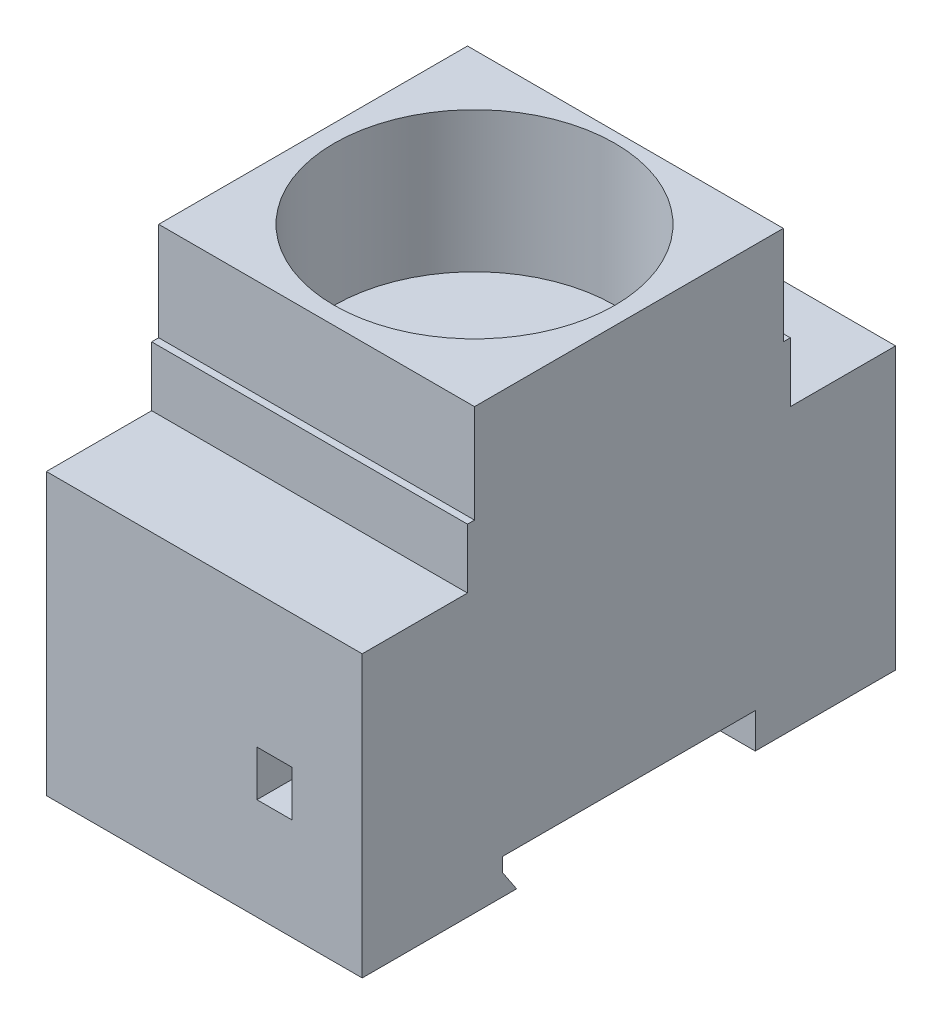
ISO-10303-21;
HEADER;
FILE_DESCRIPTION(('STEP AP214'),'2;1');
FILE_NAME('part.step','',(''),(''),'','','');
FILE_SCHEMA(('AUTOMOTIVE_DESIGN { 1 0 10303 214 1 1 1 1 }'));
ENDSEC;
DATA;
#1=APPLICATION_CONTEXT('core data for automotive mechanical design processes');
#2=APPLICATION_PROTOCOL_DEFINITION('international standard','automotive_design',2000,#1);
#3=PRODUCT_CONTEXT('',#1,'mechanical');
#4=PRODUCT('Part','Part','',(#3));
#5=PRODUCT_RELATED_PRODUCT_CATEGORY('part','',(#4));
#6=PRODUCT_DEFINITION_FORMATION('','',#4);
#7=PRODUCT_DEFINITION_CONTEXT('part definition',#1,'design');
#8=PRODUCT_DEFINITION('design','',#6,#7);
#9=PRODUCT_DEFINITION_SHAPE('','',#8);
#10=(LENGTH_UNIT() NAMED_UNIT(*) SI_UNIT(.MILLI.,.METRE.));
#11=(NAMED_UNIT(*) PLANE_ANGLE_UNIT() SI_UNIT($,.RADIAN.));
#12=(NAMED_UNIT(*) SI_UNIT($,.STERADIAN.) SOLID_ANGLE_UNIT());
#13=UNCERTAINTY_MEASURE_WITH_UNIT(LENGTH_MEASURE(1.E-05),#10,'distance_accuracy_value','');
#14=(GEOMETRIC_REPRESENTATION_CONTEXT(3) GLOBAL_UNCERTAINTY_ASSIGNED_CONTEXT((#13)) GLOBAL_UNIT_ASSIGNED_CONTEXT((#10,
#11,#12)) REPRESENTATION_CONTEXT('',''));
#15=CARTESIAN_POINT('',(0.,0.,0.));
#16=DIRECTION('',(0.,0.,1.));
#17=DIRECTION('',(1.,0.,0.));
#18=AXIS2_PLACEMENT_3D('',#15,#16,#17);
#19=CARTESIAN_POINT('',(45.,0.,0.));
#20=DIRECTION('',(0.,1.,0.));
#21=DIRECTION('',(0.,0.,1.));
#22=AXIS2_PLACEMENT_3D('',#19,#20,#21);
#23=PLANE('',#22);
#24=DIRECTION('',(0.,0.,-1.));
#25=VECTOR('',#24,1.);
#26=CARTESIAN_POINT('',(0.,0.,0.));
#27=LINE('',#26,#25);
#28=CARTESIAN_POINT('',(0.,0.,0.));
#29=VERTEX_POINT('',#28);
#30=CARTESIAN_POINT('',(0.,0.,-22.));
#31=VERTEX_POINT('',#30);
#32=EDGE_CURVE('E330',#29,#31,#27,.T.);
#33=ORIENTED_EDGE('',*,*,#32,.T.);
#34=DIRECTION('',(-1.,0.,0.));
#35=VECTOR('',#34,1.);
#36=CARTESIAN_POINT('',(45.,0.,-22.));
#37=LINE('',#36,#35);
#38=CARTESIAN_POINT('',(45.,0.,-22.));
#39=VERTEX_POINT('',#38);
#40=EDGE_CURVE('E11',#39,#31,#37,.T.);
#41=ORIENTED_EDGE('',*,*,#40,.F.);
#42=DIRECTION('',(0.,0.,-1.));
#43=VECTOR('',#42,1.);
#44=CARTESIAN_POINT('',(45.,0.,0.));
#45=LINE('',#44,#43);
#46=CARTESIAN_POINT('',(45.,0.,0.));
#47=VERTEX_POINT('',#46);
#48=EDGE_CURVE('E333',#47,#39,#45,.T.);
#49=ORIENTED_EDGE('',*,*,#48,.F.);
#50=DIRECTION('',(-1.,0.,0.));
#51=VECTOR('',#50,1.);
#52=CARTESIAN_POINT('',(45.,0.,0.));
#53=LINE('',#52,#51);
#54=EDGE_CURVE('E369',#47,#29,#53,.T.);
#55=ORIENTED_EDGE('',*,*,#54,.T.);
#56=EDGE_LOOP('',(#33,#41,#49,#55));
#57=FACE_BOUND('',#56,.T.);
#58=ADVANCED_FACE('F36',(#57),#23,.F.);
#59=CARTESIAN_POINT('',(45.,3.,-20.));
#60=DIRECTION('',(0.,-0.554700196225229,0.832050294337844));
#61=DIRECTION('',(0.,-0.832050294337844,-0.554700196225229));
#62=AXIS2_PLACEMENT_3D('',#59,#60,#61);
#63=PLANE('',#62);
#64=DIRECTION('',(0.,0.832050294337844,0.554700196225229));
#65=VECTOR('',#64,1.);
#66=CARTESIAN_POINT('',(0.,3.,-20.));
#67=LINE('',#66,#65);
#68=CARTESIAN_POINT('',(0.,3.,-20.));
#69=VERTEX_POINT('',#68);
#70=EDGE_CURVE('E372',#31,#69,#67,.T.);
#71=ORIENTED_EDGE('',*,*,#70,.T.);
#72=DIRECTION('',(-1.,0.,0.));
#73=VECTOR('',#72,1.);
#74=CARTESIAN_POINT('',(45.,3.,-20.));
#75=LINE('',#74,#73);
#76=CARTESIAN_POINT('',(45.,3.,-20.));
#77=VERTEX_POINT('',#76);
#78=EDGE_CURVE('E43',#77,#69,#75,.T.);
#79=ORIENTED_EDGE('',*,*,#78,.F.);
#80=DIRECTION('',(0.,0.832050294337844,0.554700196225229));
#81=VECTOR('',#80,1.);
#82=CARTESIAN_POINT('',(45.,3.,-20.));
#83=LINE('',#82,#81);
#84=EDGE_CURVE('E336',#39,#77,#83,.T.);
#85=ORIENTED_EDGE('',*,*,#84,.F.);
#86=ORIENTED_EDGE('',*,*,#40,.T.);
#87=EDGE_LOOP('',(#71,#79,#85,#86));
#88=FACE_BOUND('',#87,.T.);
#89=ADVANCED_FACE('F474',(#88),#63,.F.);
#90=CARTESIAN_POINT('',(45.,5.,-20.));
#91=DIRECTION('',(0.,0.,1.));
#92=DIRECTION('',(1.,0.,0.));
#93=AXIS2_PLACEMENT_3D('',#90,#91,#92);
#94=PLANE('',#93);
#95=DIRECTION('',(0.,1.,0.));
#96=VECTOR('',#95,1.);
#97=CARTESIAN_POINT('',(0.,5.,-20.));
#98=LINE('',#97,#96);
#99=CARTESIAN_POINT('',(0.,5.,-20.));
#100=VERTEX_POINT('',#99);
#101=EDGE_CURVE('E374',#69,#100,#98,.T.);
#102=ORIENTED_EDGE('',*,*,#101,.T.);
#103=DIRECTION('',(-1.,0.,0.));
#104=VECTOR('',#103,1.);
#105=CARTESIAN_POINT('',(45.,5.,-20.));
#106=LINE('',#105,#104);
#107=CARTESIAN_POINT('',(45.,5.,-20.));
#108=VERTEX_POINT('',#107);
#109=EDGE_CURVE('E444',#108,#100,#106,.T.);
#110=ORIENTED_EDGE('',*,*,#109,.F.);
#111=DIRECTION('',(0.,1.,0.));
#112=VECTOR('',#111,1.);
#113=CARTESIAN_POINT('',(45.,5.,-20.));
#114=LINE('',#113,#112);
#115=EDGE_CURVE('E339',#77,#108,#114,.T.);
#116=ORIENTED_EDGE('',*,*,#115,.F.);
#117=ORIENTED_EDGE('',*,*,#78,.T.);
#118=EDGE_LOOP('',(#102,#110,#116,#117));
#119=FACE_BOUND('',#118,.T.);
#120=ADVANCED_FACE('F451',(#119),#94,.F.);
#121=CARTESIAN_POINT('',(45.,5.,-20.));
#122=DIRECTION('',(0.,1.,0.));
#123=DIRECTION('',(0.,0.,1.));
#124=AXIS2_PLACEMENT_3D('',#121,#122,#123);
#125=PLANE('',#124);
#126=DIRECTION('',(0.,0.,-1.));
#127=VECTOR('',#126,1.);
#128=CARTESIAN_POINT('',(0.,5.,-20.));
#129=LINE('',#128,#127);
#130=CARTESIAN_POINT('',(0.,5.,-56.));
#131=VERTEX_POINT('',#130);
#132=EDGE_CURVE('E376',#100,#131,#129,.T.);
#133=ORIENTED_EDGE('',*,*,#132,.T.);
#134=DIRECTION('',(-1.,0.,0.));
#135=VECTOR('',#134,1.);
#136=CARTESIAN_POINT('',(45.,5.,-56.));
#137=LINE('',#136,#135);
#138=CARTESIAN_POINT('',(45.,5.,-56.));
#139=VERTEX_POINT('',#138);
#140=EDGE_CURVE('E441',#139,#131,#137,.T.);
#141=ORIENTED_EDGE('',*,*,#140,.F.);
#142=DIRECTION('',(0.,0.,-1.));
#143=VECTOR('',#142,1.);
#144=CARTESIAN_POINT('',(45.,5.,-20.));
#145=LINE('',#144,#143);
#146=EDGE_CURVE('E341',#108,#139,#145,.T.);
#147=ORIENTED_EDGE('',*,*,#146,.F.);
#148=ORIENTED_EDGE('',*,*,#109,.T.);
#149=EDGE_LOOP('',(#133,#141,#147,#148));
#150=FACE_BOUND('',#149,.T.);
#151=ADVANCED_FACE('F462',(#150),#125,.F.);
#152=CARTESIAN_POINT('',(45.,5.,-56.));
#153=DIRECTION('',(0.,0.,-1.));
#154=DIRECTION('',(0.,1.,0.));
#155=AXIS2_PLACEMENT_3D('',#152,#153,#154);
#156=PLANE('',#155);
#157=DIRECTION('',(0.,-1.,0.));
#158=VECTOR('',#157,1.);
#159=CARTESIAN_POINT('',(0.,5.,-56.));
#160=LINE('',#159,#158);
#161=CARTESIAN_POINT('',(0.,0.,-56.));
#162=VERTEX_POINT('',#161);
#163=EDGE_CURVE('E378',#131,#162,#160,.T.);
#164=ORIENTED_EDGE('',*,*,#163,.T.);
#165=DIRECTION('',(-1.,0.,0.));
#166=VECTOR('',#165,1.);
#167=CARTESIAN_POINT('',(45.,0.,-56.));
#168=LINE('',#167,#166);
#169=CARTESIAN_POINT('',(45.,0.,-56.));
#170=VERTEX_POINT('',#169);
#171=EDGE_CURVE('E438',#170,#162,#168,.T.);
#172=ORIENTED_EDGE('',*,*,#171,.F.);
#173=DIRECTION('',(0.,-1.,0.));
#174=VECTOR('',#173,1.);
#175=CARTESIAN_POINT('',(45.,5.,-56.));
#176=LINE('',#175,#174);
#177=EDGE_CURVE('E343',#139,#170,#176,.T.);
#178=ORIENTED_EDGE('',*,*,#177,.F.);
#179=ORIENTED_EDGE('',*,*,#140,.T.);
#180=EDGE_LOOP('',(#164,#172,#178,#179));
#181=FACE_BOUND('',#180,.T.);
#182=ADVANCED_FACE('F466',(#181),#156,.F.);
#183=CARTESIAN_POINT('',(45.,0.,-56.));
#184=DIRECTION('',(0.,1.,0.));
#185=DIRECTION('',(0.,0.,1.));
#186=AXIS2_PLACEMENT_3D('',#183,#184,#185);
#187=PLANE('',#186);
#188=DIRECTION('',(0.,0.,-1.));
#189=VECTOR('',#188,1.);
#190=CARTESIAN_POINT('',(0.,0.,-56.));
#191=LINE('',#190,#189);
#192=CARTESIAN_POINT('',(0.,0.,-76.));
#193=VERTEX_POINT('',#192);
#194=EDGE_CURVE('E380',#162,#193,#191,.T.);
#195=ORIENTED_EDGE('',*,*,#194,.T.);
#196=DIRECTION('',(-1.,0.,0.));
#197=VECTOR('',#196,1.);
#198=CARTESIAN_POINT('',(45.,0.,-76.));
#199=LINE('',#198,#197);
#200=CARTESIAN_POINT('',(45.,0.,-76.));
#201=VERTEX_POINT('',#200);
#202=EDGE_CURVE('E435',#201,#193,#199,.T.);
#203=ORIENTED_EDGE('',*,*,#202,.F.);
#204=DIRECTION('',(0.,0.,-1.));
#205=VECTOR('',#204,1.);
#206=CARTESIAN_POINT('',(45.,0.,-56.));
#207=LINE('',#206,#205);
#208=EDGE_CURVE('E345',#170,#201,#207,.T.);
#209=ORIENTED_EDGE('',*,*,#208,.F.);
#210=ORIENTED_EDGE('',*,*,#171,.T.);
#211=EDGE_LOOP('',(#195,#203,#209,#210));
#212=FACE_BOUND('',#211,.T.);
#213=ADVANCED_FACE('F532',(#212),#187,.F.);
#214=CARTESIAN_POINT('',(45.,40.,-76.));
#215=DIRECTION('',(0.,0.,1.));
#216=DIRECTION('',(1.,0.,0.));
#217=AXIS2_PLACEMENT_3D('',#214,#215,#216);
#218=PLANE('',#217);
#219=DIRECTION('',(-1.,0.,0.));
#220=VECTOR('',#219,1.);
#221=CARTESIAN_POINT('',(35.,14.5,-76.));
#222=LINE('',#221,#220);
#223=CARTESIAN_POINT('',(35.,14.5,-76.));
#224=VERTEX_POINT('',#223);
#225=CARTESIAN_POINT('',(30.,14.5,-76.));
#226=VERTEX_POINT('',#225);
#227=EDGE_CURVE('E255',#224,#226,#222,.T.);
#228=ORIENTED_EDGE('',*,*,#227,.F.);
#229=DIRECTION('',(0.,-1.,0.));
#230=VECTOR('',#229,1.);
#231=CARTESIAN_POINT('',(35.,21.,-76.));
#232=LINE('',#231,#230);
#233=CARTESIAN_POINT('',(35.,21.,-76.));
#234=VERTEX_POINT('',#233);
#235=EDGE_CURVE('E50',#234,#224,#232,.T.);
#236=ORIENTED_EDGE('',*,*,#235,.F.);
#237=DIRECTION('',(1.,0.,0.));
#238=VECTOR('',#237,1.);
#239=CARTESIAN_POINT('',(35.,21.,-76.));
#240=LINE('',#239,#238);
#241=CARTESIAN_POINT('',(30.,21.,-76.));
#242=VERTEX_POINT('',#241);
#243=EDGE_CURVE('E246',#242,#234,#240,.T.);
#244=ORIENTED_EDGE('',*,*,#243,.F.);
#245=DIRECTION('',(0.,1.,0.));
#246=VECTOR('',#245,1.);
#247=CARTESIAN_POINT('',(30.,21.,-76.));
#248=LINE('',#247,#246);
#249=EDGE_CURVE('E249',#226,#242,#248,.T.);
#250=ORIENTED_EDGE('',*,*,#249,.F.);
#251=EDGE_LOOP('',(#228,#236,#244,#250));
#252=FACE_BOUND('',#251,.T.);
#253=DIRECTION('',(-1.,0.,0.));
#254=VECTOR('',#253,1.);
#255=CARTESIAN_POINT('',(15.,14.5,-76.));
#256=LINE('',#255,#254);
#257=CARTESIAN_POINT('',(15.,14.5,-76.));
#258=VERTEX_POINT('',#257);
#259=CARTESIAN_POINT('',(10.,14.5,-76.));
#260=VERTEX_POINT('',#259);
#261=EDGE_CURVE('E279',#258,#260,#256,.T.);
#262=ORIENTED_EDGE('',*,*,#261,.F.);
#263=DIRECTION('',(0.,-1.,0.));
#264=VECTOR('',#263,1.);
#265=CARTESIAN_POINT('',(15.,21.,-76.));
#266=LINE('',#265,#264);
#267=CARTESIAN_POINT('',(15.,21.,-76.));
#268=VERTEX_POINT('',#267);
#269=EDGE_CURVE('E58',#268,#258,#266,.T.);
#270=ORIENTED_EDGE('',*,*,#269,.F.);
#271=DIRECTION('',(1.,0.,0.));
#272=VECTOR('',#271,1.);
#273=CARTESIAN_POINT('',(15.,21.,-76.));
#274=LINE('',#273,#272);
#275=CARTESIAN_POINT('',(10.,21.,-76.));
#276=VERTEX_POINT('',#275);
#277=EDGE_CURVE('E268',#276,#268,#274,.T.);
#278=ORIENTED_EDGE('',*,*,#277,.F.);
#279=DIRECTION('',(0.,1.,0.));
#280=VECTOR('',#279,1.);
#281=CARTESIAN_POINT('',(10.,21.,-76.));
#282=LINE('',#281,#280);
#283=EDGE_CURVE('E282',#260,#276,#282,.T.);
#284=ORIENTED_EDGE('',*,*,#283,.F.);
#285=EDGE_LOOP('',(#262,#270,#278,#284));
#286=FACE_BOUND('',#285,.T.);
#287=DIRECTION('',(0.,1.,0.));
#288=VECTOR('',#287,1.);
#289=CARTESIAN_POINT('',(0.,40.,-76.));
#290=LINE('',#289,#288);
#291=CARTESIAN_POINT('',(0.,40.,-76.));
#292=VERTEX_POINT('',#291);
#293=EDGE_CURVE('E382',#193,#292,#290,.T.);
#294=ORIENTED_EDGE('',*,*,#293,.T.);
#295=DIRECTION('',(-1.,0.,0.));
#296=VECTOR('',#295,1.);
#297=CARTESIAN_POINT('',(45.,40.,-76.));
#298=LINE('',#297,#296);
#299=CARTESIAN_POINT('',(45.,40.,-76.));
#300=VERTEX_POINT('',#299);
#301=EDGE_CURVE('E432',#300,#292,#298,.T.);
#302=ORIENTED_EDGE('',*,*,#301,.F.);
#303=DIRECTION('',(0.,1.,0.));
#304=VECTOR('',#303,1.);
#305=CARTESIAN_POINT('',(45.,40.,-76.));
#306=LINE('',#305,#304);
#307=EDGE_CURVE('E347',#201,#300,#306,.T.);
#308=ORIENTED_EDGE('',*,*,#307,.F.);
#309=ORIENTED_EDGE('',*,*,#202,.T.);
#310=EDGE_LOOP('',(#294,#302,#308,#309));
#311=FACE_BOUND('',#310,.T.);
#312=ADVANCED_FACE('F530',(#252,#286,#311),#218,.F.);
#313=CARTESIAN_POINT('',(45.,40.,-61.));
#314=DIRECTION('',(0.,-1.,0.));
#315=DIRECTION('',(0.,0.,-1.));
#316=AXIS2_PLACEMENT_3D('',#313,#314,#315);
#317=PLANE('',#316);
#318=DIRECTION('',(0.,0.,1.));
#319=VECTOR('',#318,1.);
#320=CARTESIAN_POINT('',(0.,40.,-61.));
#321=LINE('',#320,#319);
#322=CARTESIAN_POINT('',(0.,40.,-61.));
#323=VERTEX_POINT('',#322);
#324=EDGE_CURVE('E384',#292,#323,#321,.T.);
#325=ORIENTED_EDGE('',*,*,#324,.T.);
#326=DIRECTION('',(-1.,0.,0.));
#327=VECTOR('',#326,1.);
#328=CARTESIAN_POINT('',(45.,40.,-61.));
#329=LINE('',#328,#327);
#330=CARTESIAN_POINT('',(45.,40.,-61.));
#331=VERTEX_POINT('',#330);
#332=EDGE_CURVE('E429',#331,#323,#329,.T.);
#333=ORIENTED_EDGE('',*,*,#332,.F.);
#334=DIRECTION('',(0.,0.,1.));
#335=VECTOR('',#334,1.);
#336=CARTESIAN_POINT('',(45.,40.,-61.));
#337=LINE('',#336,#335);
#338=EDGE_CURVE('E349',#300,#331,#337,.T.);
#339=ORIENTED_EDGE('',*,*,#338,.F.);
#340=ORIENTED_EDGE('',*,*,#301,.T.);
#341=EDGE_LOOP('',(#325,#333,#339,#340));
#342=FACE_BOUND('',#341,.T.);
#343=ADVANCED_FACE('F525',(#342),#317,.F.);
#344=CARTESIAN_POINT('',(45.,48.5,-61.));
#345=DIRECTION('',(0.,0.,1.));
#346=DIRECTION('',(1.,0.,0.));
#347=AXIS2_PLACEMENT_3D('',#344,#345,#346);
#348=PLANE('',#347);
#349=DIRECTION('',(0.,1.,0.));
#350=VECTOR('',#349,1.);
#351=CARTESIAN_POINT('',(0.,48.5,-61.));
#352=LINE('',#351,#350);
#353=CARTESIAN_POINT('',(0.,48.5,-61.));
#354=VERTEX_POINT('',#353);
#355=EDGE_CURVE('E386',#323,#354,#352,.T.);
#356=ORIENTED_EDGE('',*,*,#355,.T.);
#357=DIRECTION('',(-1.,0.,0.));
#358=VECTOR('',#357,1.);
#359=CARTESIAN_POINT('',(45.,48.5,-61.));
#360=LINE('',#359,#358);
#361=CARTESIAN_POINT('',(45.,48.5,-61.));
#362=VERTEX_POINT('',#361);
#363=EDGE_CURVE('E426',#362,#354,#360,.T.);
#364=ORIENTED_EDGE('',*,*,#363,.F.);
#365=DIRECTION('',(0.,1.,0.));
#366=VECTOR('',#365,1.);
#367=CARTESIAN_POINT('',(45.,48.5,-61.));
#368=LINE('',#367,#366);
#369=EDGE_CURVE('E351',#331,#362,#368,.T.);
#370=ORIENTED_EDGE('',*,*,#369,.F.);
#371=ORIENTED_EDGE('',*,*,#332,.T.);
#372=EDGE_LOOP('',(#356,#364,#370,#371));
#373=FACE_BOUND('',#372,.T.);
#374=ADVANCED_FACE('F520',(#373),#348,.F.);
#375=CARTESIAN_POINT('',(45.,48.5,-60.));
#376=DIRECTION('',(0.,-1.,0.));
#377=DIRECTION('',(0.,0.,-1.));
#378=AXIS2_PLACEMENT_3D('',#375,#376,#377);
#379=PLANE('',#378);
#380=DIRECTION('',(0.,0.,1.));
#381=VECTOR('',#380,1.);
#382=CARTESIAN_POINT('',(0.,48.5,-60.));
#383=LINE('',#382,#381);
#384=CARTESIAN_POINT('',(0.,48.5,-60.));
#385=VERTEX_POINT('',#384);
#386=EDGE_CURVE('E388',#354,#385,#383,.T.);
#387=ORIENTED_EDGE('',*,*,#386,.T.);
#388=DIRECTION('',(-1.,0.,0.));
#389=VECTOR('',#388,1.);
#390=CARTESIAN_POINT('',(45.,48.5,-60.));
#391=LINE('',#390,#389);
#392=CARTESIAN_POINT('',(45.,48.5,-60.));
#393=VERTEX_POINT('',#392);
#394=EDGE_CURVE('E423',#393,#385,#391,.T.);
#395=ORIENTED_EDGE('',*,*,#394,.F.);
#396=DIRECTION('',(0.,0.,1.));
#397=VECTOR('',#396,1.);
#398=CARTESIAN_POINT('',(45.,48.5,-60.));
#399=LINE('',#398,#397);
#400=EDGE_CURVE('E353',#362,#393,#399,.T.);
#401=ORIENTED_EDGE('',*,*,#400,.F.);
#402=ORIENTED_EDGE('',*,*,#363,.T.);
#403=EDGE_LOOP('',(#387,#395,#401,#402));
#404=FACE_BOUND('',#403,.T.);
#405=ADVANCED_FACE('F516',(#404),#379,.F.);
#406=CARTESIAN_POINT('',(45.,62.5,-60.));
#407=DIRECTION('',(0.,0.,1.));
#408=DIRECTION('',(1.,0.,0.));
#409=AXIS2_PLACEMENT_3D('',#406,#407,#408);
#410=PLANE('',#409);
#411=DIRECTION('',(0.,1.,0.));
#412=VECTOR('',#411,1.);
#413=CARTESIAN_POINT('',(0.,62.5,-60.));
#414=LINE('',#413,#412);
#415=CARTESIAN_POINT('',(0.,62.5,-60.));
#416=VERTEX_POINT('',#415);
#417=EDGE_CURVE('E390',#385,#416,#414,.T.);
#418=ORIENTED_EDGE('',*,*,#417,.T.);
#419=DIRECTION('',(-1.,0.,0.));
#420=VECTOR('',#419,1.);
#421=CARTESIAN_POINT('',(45.,62.5,-60.));
#422=LINE('',#421,#420);
#423=CARTESIAN_POINT('',(45.,62.5,-60.));
#424=VERTEX_POINT('',#423);
#425=EDGE_CURVE('E420',#424,#416,#422,.T.);
#426=ORIENTED_EDGE('',*,*,#425,.F.);
#427=DIRECTION('',(0.,1.,0.));
#428=VECTOR('',#427,1.);
#429=CARTESIAN_POINT('',(45.,62.5,-60.));
#430=LINE('',#429,#428);
#431=EDGE_CURVE('E355',#393,#424,#430,.T.);
#432=ORIENTED_EDGE('',*,*,#431,.F.);
#433=ORIENTED_EDGE('',*,*,#394,.T.);
#434=EDGE_LOOP('',(#418,#426,#432,#433));
#435=FACE_BOUND('',#434,.T.);
#436=ADVANCED_FACE('F511',(#435),#410,.F.);
#437=CARTESIAN_POINT('',(45.,62.5,-16.));
#438=DIRECTION('',(0.,-1.,0.));
#439=DIRECTION('',(0.,0.,-1.));
#440=AXIS2_PLACEMENT_3D('',#437,#438,#439);
#441=PLANE('',#440);
#442=CARTESIAN_POINT('',(22.5,62.5,-38.5));
#443=DIRECTION('',(0.,1.,0.));
#444=DIRECTION('',(0.,0.,1.));
#445=AXIS2_PLACEMENT_3D('',#442,#443,#444);
#446=CIRCLE('',#445,20.);
#447=CARTESIAN_POINT('',(22.5,62.5,-18.5));
#448=VERTEX_POINT('',#447);
#449=EDGE_CURVE('E320',#448,#448,#446,.T.);
#450=ORIENTED_EDGE('',*,*,#449,.F.);
#451=EDGE_LOOP('',(#450));
#452=FACE_BOUND('',#451,.T.);
#453=DIRECTION('',(0.,0.,1.));
#454=VECTOR('',#453,1.);
#455=CARTESIAN_POINT('',(0.,62.5,-16.));
#456=LINE('',#455,#454);
#457=CARTESIAN_POINT('',(0.,62.5,-16.));
#458=VERTEX_POINT('',#457);
#459=EDGE_CURVE('E392',#416,#458,#456,.T.);
#460=ORIENTED_EDGE('',*,*,#459,.T.);
#461=DIRECTION('',(-1.,0.,0.));
#462=VECTOR('',#461,1.);
#463=CARTESIAN_POINT('',(45.,62.5,-16.));
#464=LINE('',#463,#462);
#465=CARTESIAN_POINT('',(45.,62.5,-16.));
#466=VERTEX_POINT('',#465);
#467=EDGE_CURVE('E417',#466,#458,#464,.T.);
#468=ORIENTED_EDGE('',*,*,#467,.F.);
#469=DIRECTION('',(0.,0.,1.));
#470=VECTOR('',#469,1.);
#471=CARTESIAN_POINT('',(45.,62.5,-16.));
#472=LINE('',#471,#470);
#473=EDGE_CURVE('E357',#424,#466,#472,.T.);
#474=ORIENTED_EDGE('',*,*,#473,.F.);
#475=ORIENTED_EDGE('',*,*,#425,.T.);
#476=EDGE_LOOP('',(#460,#468,#474,#475));
#477=FACE_BOUND('',#476,.T.);
#478=ADVANCED_FACE('F505',(#452,#477),#441,.F.);
#479=CARTESIAN_POINT('',(45.,48.5,-16.));
#480=DIRECTION('',(0.,0.,-1.));
#481=DIRECTION('',(-1.,0.,0.));
#482=AXIS2_PLACEMENT_3D('',#479,#480,#481);
#483=PLANE('',#482);
#484=DIRECTION('',(0.,-1.,0.));
#485=VECTOR('',#484,1.);
#486=CARTESIAN_POINT('',(0.,48.5,-16.));
#487=LINE('',#486,#485);
#488=CARTESIAN_POINT('',(0.,48.5,-16.));
#489=VERTEX_POINT('',#488);
#490=EDGE_CURVE('E394',#458,#489,#487,.T.);
#491=ORIENTED_EDGE('',*,*,#490,.T.);
#492=DIRECTION('',(-1.,0.,0.));
#493=VECTOR('',#492,1.);
#494=CARTESIAN_POINT('',(45.,48.5,-16.));
#495=LINE('',#494,#493);
#496=CARTESIAN_POINT('',(45.,48.5,-16.));
#497=VERTEX_POINT('',#496);
#498=EDGE_CURVE('E414',#497,#489,#495,.T.);
#499=ORIENTED_EDGE('',*,*,#498,.F.);
#500=DIRECTION('',(0.,-1.,0.));
#501=VECTOR('',#500,1.);
#502=CARTESIAN_POINT('',(45.,48.5,-16.));
#503=LINE('',#502,#501);
#504=EDGE_CURVE('E359',#466,#497,#503,.T.);
#505=ORIENTED_EDGE('',*,*,#504,.F.);
#506=ORIENTED_EDGE('',*,*,#467,.T.);
#507=EDGE_LOOP('',(#491,#499,#505,#506));
#508=FACE_BOUND('',#507,.T.);
#509=ADVANCED_FACE('F501',(#508),#483,.F.);
#510=CARTESIAN_POINT('',(45.,48.5,-15.));
#511=DIRECTION('',(0.,-1.,0.));
#512=DIRECTION('',(0.,0.,-1.));
#513=AXIS2_PLACEMENT_3D('',#510,#511,#512);
#514=PLANE('',#513);
#515=DIRECTION('',(0.,0.,1.));
#516=VECTOR('',#515,1.);
#517=CARTESIAN_POINT('',(0.,48.5,-15.));
#518=LINE('',#517,#516);
#519=CARTESIAN_POINT('',(0.,48.5,-15.));
#520=VERTEX_POINT('',#519);
#521=EDGE_CURVE('E396',#489,#520,#518,.T.);
#522=ORIENTED_EDGE('',*,*,#521,.T.);
#523=DIRECTION('',(-1.,0.,0.));
#524=VECTOR('',#523,1.);
#525=CARTESIAN_POINT('',(45.,48.5,-15.));
#526=LINE('',#525,#524);
#527=CARTESIAN_POINT('',(45.,48.5,-15.));
#528=VERTEX_POINT('',#527);
#529=EDGE_CURVE('E411',#528,#520,#526,.T.);
#530=ORIENTED_EDGE('',*,*,#529,.F.);
#531=DIRECTION('',(0.,0.,1.));
#532=VECTOR('',#531,1.);
#533=CARTESIAN_POINT('',(45.,48.5,-15.));
#534=LINE('',#533,#532);
#535=EDGE_CURVE('E361',#497,#528,#534,.T.);
#536=ORIENTED_EDGE('',*,*,#535,.F.);
#537=ORIENTED_EDGE('',*,*,#498,.T.);
#538=EDGE_LOOP('',(#522,#530,#536,#537));
#539=FACE_BOUND('',#538,.T.);
#540=ADVANCED_FACE('F496',(#539),#514,.F.);
#541=CARTESIAN_POINT('',(45.,40.,-15.));
#542=DIRECTION('',(0.,0.,-1.));
#543=DIRECTION('',(-1.,0.,0.));
#544=AXIS2_PLACEMENT_3D('',#541,#542,#543);
#545=PLANE('',#544);
#546=DIRECTION('',(0.,-1.,0.));
#547=VECTOR('',#546,1.);
#548=CARTESIAN_POINT('',(0.,40.,-15.));
#549=LINE('',#548,#547);
#550=CARTESIAN_POINT('',(0.,40.,-15.));
#551=VERTEX_POINT('',#550);
#552=EDGE_CURVE('E398',#520,#551,#549,.T.);
#553=ORIENTED_EDGE('',*,*,#552,.T.);
#554=DIRECTION('',(-1.,0.,0.));
#555=VECTOR('',#554,1.);
#556=CARTESIAN_POINT('',(45.,40.,-15.));
#557=LINE('',#556,#555);
#558=CARTESIAN_POINT('',(45.,40.,-15.));
#559=VERTEX_POINT('',#558);
#560=EDGE_CURVE('E408',#559,#551,#557,.T.);
#561=ORIENTED_EDGE('',*,*,#560,.F.);
#562=DIRECTION('',(0.,-1.,0.));
#563=VECTOR('',#562,1.);
#564=CARTESIAN_POINT('',(45.,40.,-15.));
#565=LINE('',#564,#563);
#566=EDGE_CURVE('E363',#528,#559,#565,.T.);
#567=ORIENTED_EDGE('',*,*,#566,.F.);
#568=ORIENTED_EDGE('',*,*,#529,.T.);
#569=EDGE_LOOP('',(#553,#561,#567,#568));
#570=FACE_BOUND('',#569,.T.);
#571=ADVANCED_FACE('F490',(#570),#545,.F.);
#572=CARTESIAN_POINT('',(45.,40.,0.));
#573=DIRECTION('',(0.,-1.,0.));
#574=DIRECTION('',(0.,0.,-1.));
#575=AXIS2_PLACEMENT_3D('',#572,#573,#574);
#576=PLANE('',#575);
#577=DIRECTION('',(0.,0.,1.));
#578=VECTOR('',#577,1.);
#579=CARTESIAN_POINT('',(0.,40.,0.));
#580=LINE('',#579,#578);
#581=CARTESIAN_POINT('',(0.,40.,0.));
#582=VERTEX_POINT('',#581);
#583=EDGE_CURVE('E400',#551,#582,#580,.T.);
#584=ORIENTED_EDGE('',*,*,#583,.T.);
#585=DIRECTION('',(-1.,0.,0.));
#586=VECTOR('',#585,1.);
#587=CARTESIAN_POINT('',(45.,40.,0.));
#588=LINE('',#587,#586);
#589=CARTESIAN_POINT('',(45.,40.,0.));
#590=VERTEX_POINT('',#589);
#591=EDGE_CURVE('E405',#590,#582,#588,.T.);
#592=ORIENTED_EDGE('',*,*,#591,.F.);
#593=DIRECTION('',(0.,0.,1.));
#594=VECTOR('',#593,1.);
#595=CARTESIAN_POINT('',(45.,40.,0.));
#596=LINE('',#595,#594);
#597=EDGE_CURVE('E365',#559,#590,#596,.T.);
#598=ORIENTED_EDGE('',*,*,#597,.F.);
#599=ORIENTED_EDGE('',*,*,#560,.T.);
#600=EDGE_LOOP('',(#584,#592,#598,#599));
#601=FACE_BOUND('',#600,.T.);
#602=ADVANCED_FACE('F486',(#601),#576,.F.);
#603=CARTESIAN_POINT('',(45.,0.,0.));
#604=DIRECTION('',(0.,0.,-1.));
#605=DIRECTION('',(-1.,0.,0.));
#606=AXIS2_PLACEMENT_3D('',#603,#604,#605);
#607=PLANE('',#606);
#608=DIRECTION('',(1.,0.,0.));
#609=VECTOR('',#608,1.);
#610=CARTESIAN_POINT('',(30.,14.5,0.));
#611=LINE('',#610,#609);
#612=CARTESIAN_POINT('',(30.,14.5,0.));
#613=VERTEX_POINT('',#612);
#614=CARTESIAN_POINT('',(35.,14.5,0.));
#615=VERTEX_POINT('',#614);
#616=EDGE_CURVE('E310',#613,#615,#611,.T.);
#617=ORIENTED_EDGE('',*,*,#616,.F.);
#618=DIRECTION('',(0.,-1.,0.));
#619=VECTOR('',#618,1.);
#620=CARTESIAN_POINT('',(30.,21.,0.));
#621=LINE('',#620,#619);
#622=CARTESIAN_POINT('',(30.,21.,0.));
#623=VERTEX_POINT('',#622);
#624=EDGE_CURVE('E289',#623,#613,#621,.T.);
#625=ORIENTED_EDGE('',*,*,#624,.F.);
#626=DIRECTION('',(-1.,0.,0.));
#627=VECTOR('',#626,1.);
#628=CARTESIAN_POINT('',(30.,21.,0.));
#629=LINE('',#628,#627);
#630=CARTESIAN_POINT('',(35.,21.,0.));
#631=VERTEX_POINT('',#630);
#632=EDGE_CURVE('E299',#631,#623,#629,.T.);
#633=ORIENTED_EDGE('',*,*,#632,.F.);
#634=DIRECTION('',(0.,1.,0.));
#635=VECTOR('',#634,1.);
#636=CARTESIAN_POINT('',(35.,21.,0.));
#637=LINE('',#636,#635);
#638=EDGE_CURVE('E313',#615,#631,#637,.T.);
#639=ORIENTED_EDGE('',*,*,#638,.F.);
#640=EDGE_LOOP('',(#617,#625,#633,#639));
#641=FACE_BOUND('',#640,.T.);
#642=DIRECTION('',(0.,-1.,0.));
#643=VECTOR('',#642,1.);
#644=CARTESIAN_POINT('',(0.,0.,0.));
#645=LINE('',#644,#643);
#646=EDGE_CURVE('E337',#582,#29,#645,.T.);
#647=ORIENTED_EDGE('',*,*,#646,.T.);
#648=ORIENTED_EDGE('',*,*,#54,.F.);
#649=DIRECTION('',(0.,-1.,0.));
#650=VECTOR('',#649,1.);
#651=CARTESIAN_POINT('',(45.,0.,0.));
#652=LINE('',#651,#650);
#653=EDGE_CURVE('E367',#590,#47,#652,.T.);
#654=ORIENTED_EDGE('',*,*,#653,.F.);
#655=ORIENTED_EDGE('',*,*,#591,.T.);
#656=EDGE_LOOP('',(#647,#648,#654,#655));
#657=FACE_BOUND('',#656,.T.);
#658=ADVANCED_FACE('F481',(#641,#657),#607,.F.);
#659=CARTESIAN_POINT('',(45.,0.,0.));
#660=DIRECTION('',(-1.,0.,0.));
#661=DIRECTION('',(0.,0.,1.));
#662=AXIS2_PLACEMENT_3D('',#659,#660,#661);
#663=PLANE('',#662);
#664=ORIENTED_EDGE('',*,*,#48,.T.);
#665=ORIENTED_EDGE('',*,*,#84,.T.);
#666=ORIENTED_EDGE('',*,*,#115,.T.);
#667=ORIENTED_EDGE('',*,*,#146,.T.);
#668=ORIENTED_EDGE('',*,*,#177,.T.);
#669=ORIENTED_EDGE('',*,*,#208,.T.);
#670=ORIENTED_EDGE('',*,*,#307,.T.);
#671=ORIENTED_EDGE('',*,*,#338,.T.);
#672=ORIENTED_EDGE('',*,*,#369,.T.);
#673=ORIENTED_EDGE('',*,*,#400,.T.);
#674=ORIENTED_EDGE('',*,*,#431,.T.);
#675=ORIENTED_EDGE('',*,*,#473,.T.);
#676=ORIENTED_EDGE('',*,*,#504,.T.);
#677=ORIENTED_EDGE('',*,*,#535,.T.);
#678=ORIENTED_EDGE('',*,*,#566,.T.);
#679=ORIENTED_EDGE('',*,*,#597,.T.);
#680=ORIENTED_EDGE('',*,*,#653,.T.);
#681=EDGE_LOOP('',(#664,#665,#666,#667,#668,#669,#670,#671,#672,#673,#674,#675,#676,#677,#678,
#679,#680));
#682=FACE_BOUND('',#681,.T.);
#683=ADVANCED_FACE('F470',(#682),#663,.F.);
#684=CARTESIAN_POINT('',(0.,0.,0.));
#685=DIRECTION('',(-1.,0.,0.));
#686=DIRECTION('',(0.,0.,1.));
#687=AXIS2_PLACEMENT_3D('',#684,#685,#686);
#688=PLANE('',#687);
#689=ORIENTED_EDGE('',*,*,#32,.F.);
#690=ORIENTED_EDGE('',*,*,#646,.F.);
#691=ORIENTED_EDGE('',*,*,#583,.F.);
#692=ORIENTED_EDGE('',*,*,#552,.F.);
#693=ORIENTED_EDGE('',*,*,#521,.F.);
#694=ORIENTED_EDGE('',*,*,#490,.F.);
#695=ORIENTED_EDGE('',*,*,#459,.F.);
#696=ORIENTED_EDGE('',*,*,#417,.F.);
#697=ORIENTED_EDGE('',*,*,#386,.F.);
#698=ORIENTED_EDGE('',*,*,#355,.F.);
#699=ORIENTED_EDGE('',*,*,#324,.F.);
#700=ORIENTED_EDGE('',*,*,#293,.F.);
#701=ORIENTED_EDGE('',*,*,#194,.F.);
#702=ORIENTED_EDGE('',*,*,#163,.F.);
#703=ORIENTED_EDGE('',*,*,#132,.F.);
#704=ORIENTED_EDGE('',*,*,#101,.F.);
#705=ORIENTED_EDGE('',*,*,#70,.F.);
#706=EDGE_LOOP('',(#689,#690,#691,#692,#693,#694,#695,#696,#697,#698,#699,#700,#701,#702,#703,
#704,#705));
#707=FACE_BOUND('',#706,.T.);
#708=ADVANCED_FACE('F457',(#707),#688,.T.);
#709=CARTESIAN_POINT('',(22.5,42.5,-38.5));
#710=DIRECTION('',(0.,1.,0.));
#711=DIRECTION('',(0.,0.,1.));
#712=AXIS2_PLACEMENT_3D('',#709,#710,#711);
#713=CYLINDRICAL_SURFACE('',#712,20.);
#714=CARTESIAN_POINT('',(22.5,42.5,-38.5));
#715=DIRECTION('',(0.,1.,0.));
#716=DIRECTION('',(0.,0.,1.));
#717=AXIS2_PLACEMENT_3D('',#714,#715,#716);
#718=CIRCLE('',#717,20.);
#719=CARTESIAN_POINT('',(22.5,42.5,-18.5));
#720=VERTEX_POINT('',#719);
#721=EDGE_CURVE('E327',#720,#720,#718,.T.);
#722=ORIENTED_EDGE('',*,*,#721,.F.);
#723=EDGE_LOOP('',(#722));
#724=FACE_BOUND('',#723,.T.);
#725=ORIENTED_EDGE('',*,*,#449,.T.);
#726=EDGE_LOOP('',(#725));
#727=FACE_BOUND('',#726,.T.);
#728=ADVANCED_FACE('F650',(#724,#727),#713,.F.);
#729=CARTESIAN_POINT('',(22.5,42.5,-38.5));
#730=DIRECTION('',(0.,1.,0.));
#731=DIRECTION('',(0.,0.,1.));
#732=AXIS2_PLACEMENT_3D('',#729,#730,#731);
#733=PLANE('',#732);
#734=ORIENTED_EDGE('',*,*,#721,.T.);
#735=EDGE_LOOP('',(#734));
#736=FACE_BOUND('',#735,.T.);
#737=ADVANCED_FACE('F666',(#736),#733,.T.);
#738=CARTESIAN_POINT('',(30.,21.,-20.));
#739=DIRECTION('',(-1.,0.,0.));
#740=DIRECTION('',(0.,-1.,0.));
#741=AXIS2_PLACEMENT_3D('',#738,#739,#740);
#742=PLANE('',#741);
#743=ORIENTED_EDGE('',*,*,#624,.T.);
#744=DIRECTION('',(0.,0.,1.));
#745=VECTOR('',#744,1.);
#746=CARTESIAN_POINT('',(30.,14.5,-20.));
#747=LINE('',#746,#745);
#748=CARTESIAN_POINT('',(30.,14.5,-20.));
#749=VERTEX_POINT('',#748);
#750=EDGE_CURVE('E308',#749,#613,#747,.T.);
#751=ORIENTED_EDGE('',*,*,#750,.F.);
#752=DIRECTION('',(0.,-1.,0.));
#753=VECTOR('',#752,1.);
#754=CARTESIAN_POINT('',(30.,21.,-20.));
#755=LINE('',#754,#753);
#756=CARTESIAN_POINT('',(30.,21.,-20.));
#757=VERTEX_POINT('',#756);
#758=EDGE_CURVE('E295',#757,#749,#755,.T.);
#759=ORIENTED_EDGE('',*,*,#758,.F.);
#760=DIRECTION('',(0.,0.,1.));
#761=VECTOR('',#760,1.);
#762=CARTESIAN_POINT('',(30.,21.,-20.));
#763=LINE('',#762,#761);
#764=EDGE_CURVE('E318',#757,#623,#763,.T.);
#765=ORIENTED_EDGE('',*,*,#764,.T.);
#766=EDGE_LOOP('',(#743,#751,#759,#765));
#767=FACE_BOUND('',#766,.T.);
#768=ADVANCED_FACE('F676',(#767),#742,.F.);
#769=CARTESIAN_POINT('',(30.,21.,-20.));
#770=DIRECTION('',(0.,1.,0.));
#771=DIRECTION('',(0.,0.,1.));
#772=AXIS2_PLACEMENT_3D('',#769,#770,#771);
#773=PLANE('',#772);
#774=ORIENTED_EDGE('',*,*,#632,.T.);
#775=ORIENTED_EDGE('',*,*,#764,.F.);
#776=DIRECTION('',(-1.,0.,0.));
#777=VECTOR('',#776,1.);
#778=CARTESIAN_POINT('',(30.,21.,-20.));
#779=LINE('',#778,#777);
#780=CARTESIAN_POINT('',(35.,21.,-20.));
#781=VERTEX_POINT('',#780);
#782=EDGE_CURVE('E305',#781,#757,#779,.T.);
#783=ORIENTED_EDGE('',*,*,#782,.F.);
#784=DIRECTION('',(0.,0.,1.));
#785=VECTOR('',#784,1.);
#786=CARTESIAN_POINT('',(35.,21.,-20.));
#787=LINE('',#786,#785);
#788=EDGE_CURVE('E321',#781,#631,#787,.T.);
#789=ORIENTED_EDGE('',*,*,#788,.T.);
#790=EDGE_LOOP('',(#774,#775,#783,#789));
#791=FACE_BOUND('',#790,.T.);
#792=ADVANCED_FACE('F693',(#791),#773,.F.);
#793=CARTESIAN_POINT('',(35.,21.,-20.));
#794=DIRECTION('',(1.,0.,0.));
#795=DIRECTION('',(0.,0.,-1.));
#796=AXIS2_PLACEMENT_3D('',#793,#794,#795);
#797=PLANE('',#796);
#798=ORIENTED_EDGE('',*,*,#638,.T.);
#799=ORIENTED_EDGE('',*,*,#788,.F.);
#800=DIRECTION('',(0.,1.,0.));
#801=VECTOR('',#800,1.);
#802=CARTESIAN_POINT('',(35.,21.,-20.));
#803=LINE('',#802,#801);
#804=CARTESIAN_POINT('',(35.,14.5,-20.));
#805=VERTEX_POINT('',#804);
#806=EDGE_CURVE('E302',#805,#781,#803,.T.);
#807=ORIENTED_EDGE('',*,*,#806,.F.);
#808=DIRECTION('',(0.,0.,1.));
#809=VECTOR('',#808,1.);
#810=CARTESIAN_POINT('',(35.,14.5,-20.));
#811=LINE('',#810,#809);
#812=EDGE_CURVE('E323',#805,#615,#811,.T.);
#813=ORIENTED_EDGE('',*,*,#812,.T.);
#814=EDGE_LOOP('',(#798,#799,#807,#813));
#815=FACE_BOUND('',#814,.T.);
#816=ADVANCED_FACE('F703',(#815),#797,.F.);
#817=CARTESIAN_POINT('',(30.,14.5,-20.));
#818=DIRECTION('',(0.,-1.,0.));
#819=DIRECTION('',(0.,0.,-1.));
#820=AXIS2_PLACEMENT_3D('',#817,#818,#819);
#821=PLANE('',#820);
#822=ORIENTED_EDGE('',*,*,#616,.T.);
#823=ORIENTED_EDGE('',*,*,#812,.F.);
#824=DIRECTION('',(1.,0.,0.));
#825=VECTOR('',#824,1.);
#826=CARTESIAN_POINT('',(30.,14.5,-20.));
#827=LINE('',#826,#825);
#828=EDGE_CURVE('E298',#749,#805,#827,.T.);
#829=ORIENTED_EDGE('',*,*,#828,.F.);
#830=ORIENTED_EDGE('',*,*,#750,.T.);
#831=EDGE_LOOP('',(#822,#823,#829,#830));
#832=FACE_BOUND('',#831,.T.);
#833=ADVANCED_FACE('F713',(#832),#821,.F.);
#834=CARTESIAN_POINT('',(0.,0.,-20.));
#835=DIRECTION('',(0.,0.,1.));
#836=DIRECTION('',(1.,0.,0.));
#837=AXIS2_PLACEMENT_3D('',#834,#835,#836);
#838=PLANE('',#837);
#839=ORIENTED_EDGE('',*,*,#758,.T.);
#840=ORIENTED_EDGE('',*,*,#828,.T.);
#841=ORIENTED_EDGE('',*,*,#806,.T.);
#842=ORIENTED_EDGE('',*,*,#782,.T.);
#843=EDGE_LOOP('',(#839,#840,#841,#842));
#844=FACE_BOUND('',#843,.T.);
#845=ADVANCED_FACE('F723',(#844),#838,.T.);
#846=CARTESIAN_POINT('',(15.,21.,-56.));
#847=DIRECTION('',(1.,0.,0.));
#848=DIRECTION('',(0.,0.,-1.));
#849=AXIS2_PLACEMENT_3D('',#846,#847,#848);
#850=PLANE('',#849);
#851=ORIENTED_EDGE('',*,*,#269,.T.);
#852=DIRECTION('',(0.,0.,-1.));
#853=VECTOR('',#852,1.);
#854=CARTESIAN_POINT('',(15.,14.5,-56.));
#855=LINE('',#854,#853);
#856=CARTESIAN_POINT('',(15.,14.5,-56.));
#857=VERTEX_POINT('',#856);
#858=EDGE_CURVE('E277',#857,#258,#855,.T.);
#859=ORIENTED_EDGE('',*,*,#858,.F.);
#860=DIRECTION('',(0.,-1.,0.));
#861=VECTOR('',#860,1.);
#862=CARTESIAN_POINT('',(15.,21.,-56.));
#863=LINE('',#862,#861);
#864=CARTESIAN_POINT('',(15.,21.,-56.));
#865=VERTEX_POINT('',#864);
#866=EDGE_CURVE('E264',#865,#857,#863,.T.);
#867=ORIENTED_EDGE('',*,*,#866,.F.);
#868=DIRECTION('',(0.,0.,-1.));
#869=VECTOR('',#868,1.);
#870=CARTESIAN_POINT('',(15.,21.,-56.));
#871=LINE('',#870,#869);
#872=EDGE_CURVE('E287',#865,#268,#871,.T.);
#873=ORIENTED_EDGE('',*,*,#872,.T.);
#874=EDGE_LOOP('',(#851,#859,#867,#873));
#875=FACE_BOUND('',#874,.T.);
#876=ADVANCED_FACE('F733',(#875),#850,.F.);
#877=CARTESIAN_POINT('',(15.,21.,-56.));
#878=DIRECTION('',(0.,1.,0.));
#879=DIRECTION('',(0.,0.,1.));
#880=AXIS2_PLACEMENT_3D('',#877,#878,#879);
#881=PLANE('',#880);
#882=ORIENTED_EDGE('',*,*,#277,.T.);
#883=ORIENTED_EDGE('',*,*,#872,.F.);
#884=DIRECTION('',(1.,0.,0.));
#885=VECTOR('',#884,1.);
#886=CARTESIAN_POINT('',(15.,21.,-56.));
#887=LINE('',#886,#885);
#888=CARTESIAN_POINT('',(10.,21.,-56.));
#889=VERTEX_POINT('',#888);
#890=EDGE_CURVE('E274',#889,#865,#887,.T.);
#891=ORIENTED_EDGE('',*,*,#890,.F.);
#892=DIRECTION('',(0.,0.,-1.));
#893=VECTOR('',#892,1.);
#894=CARTESIAN_POINT('',(10.,21.,-56.));
#895=LINE('',#894,#893);
#896=EDGE_CURVE('E290',#889,#276,#895,.T.);
#897=ORIENTED_EDGE('',*,*,#896,.T.);
#898=EDGE_LOOP('',(#882,#883,#891,#897));
#899=FACE_BOUND('',#898,.T.);
#900=ADVANCED_FACE('F748',(#899),#881,.F.);
#901=CARTESIAN_POINT('',(10.,21.,-56.));
#902=DIRECTION('',(-1.,0.,0.));
#903=DIRECTION('',(0.,0.,1.));
#904=AXIS2_PLACEMENT_3D('',#901,#902,#903);
#905=PLANE('',#904);
#906=ORIENTED_EDGE('',*,*,#283,.T.);
#907=ORIENTED_EDGE('',*,*,#896,.F.);
#908=DIRECTION('',(0.,1.,0.));
#909=VECTOR('',#908,1.);
#910=CARTESIAN_POINT('',(10.,21.,-56.));
#911=LINE('',#910,#909);
#912=CARTESIAN_POINT('',(10.,14.5,-56.));
#913=VERTEX_POINT('',#912);
#914=EDGE_CURVE('E271',#913,#889,#911,.T.);
#915=ORIENTED_EDGE('',*,*,#914,.F.);
#916=DIRECTION('',(0.,0.,-1.));
#917=VECTOR('',#916,1.);
#918=CARTESIAN_POINT('',(10.,14.5,-56.));
#919=LINE('',#918,#917);
#920=EDGE_CURVE('E292',#913,#260,#919,.T.);
#921=ORIENTED_EDGE('',*,*,#920,.T.);
#922=EDGE_LOOP('',(#906,#907,#915,#921));
#923=FACE_BOUND('',#922,.T.);
#924=ADVANCED_FACE('F757',(#923),#905,.F.);
#925=CARTESIAN_POINT('',(15.,14.5,-56.));
#926=DIRECTION('',(0.,-1.,0.));
#927=DIRECTION('',(0.,0.,-1.));
#928=AXIS2_PLACEMENT_3D('',#925,#926,#927);
#929=PLANE('',#928);
#930=ORIENTED_EDGE('',*,*,#261,.T.);
#931=ORIENTED_EDGE('',*,*,#920,.F.);
#932=DIRECTION('',(-1.,0.,0.));
#933=VECTOR('',#932,1.);
#934=CARTESIAN_POINT('',(15.,14.5,-56.));
#935=LINE('',#934,#933);
#936=EDGE_CURVE('E267',#857,#913,#935,.T.);
#937=ORIENTED_EDGE('',*,*,#936,.F.);
#938=ORIENTED_EDGE('',*,*,#858,.T.);
#939=EDGE_LOOP('',(#930,#931,#937,#938));
#940=FACE_BOUND('',#939,.T.);
#941=ADVANCED_FACE('F767',(#940),#929,.F.);
#942=CARTESIAN_POINT('',(0.,0.,-56.));
#943=DIRECTION('',(0.,0.,-1.));
#944=DIRECTION('',(-1.,0.,0.));
#945=AXIS2_PLACEMENT_3D('',#942,#943,#944);
#946=PLANE('',#945);
#947=ORIENTED_EDGE('',*,*,#866,.T.);
#948=ORIENTED_EDGE('',*,*,#936,.T.);
#949=ORIENTED_EDGE('',*,*,#914,.T.);
#950=ORIENTED_EDGE('',*,*,#890,.T.);
#951=EDGE_LOOP('',(#947,#948,#949,#950));
#952=FACE_BOUND('',#951,.T.);
#953=ADVANCED_FACE('F777',(#952),#946,.T.);
#954=CARTESIAN_POINT('',(35.,21.,-56.));
#955=DIRECTION('',(1.,0.,0.));
#956=DIRECTION('',(0.,0.,-1.));
#957=AXIS2_PLACEMENT_3D('',#954,#955,#956);
#958=PLANE('',#957);
#959=ORIENTED_EDGE('',*,*,#235,.T.);
#960=DIRECTION('',(0.,0.,-1.));
#961=VECTOR('',#960,1.);
#962=CARTESIAN_POINT('',(35.,14.5,-56.));
#963=LINE('',#962,#961);
#964=CARTESIAN_POINT('',(35.,14.5,-56.));
#965=VERTEX_POINT('',#964);
#966=EDGE_CURVE('E224',#965,#224,#963,.T.);
#967=ORIENTED_EDGE('',*,*,#966,.F.);
#968=DIRECTION('',(0.,-1.,0.));
#969=VECTOR('',#968,1.);
#970=CARTESIAN_POINT('',(35.,21.,-56.));
#971=LINE('',#970,#969);
#972=CARTESIAN_POINT('',(35.,21.,-56.));
#973=VERTEX_POINT('',#972);
#974=EDGE_CURVE('E228',#973,#965,#971,.T.);
#975=ORIENTED_EDGE('',*,*,#974,.F.);
#976=DIRECTION('',(0.,0.,-1.));
#977=VECTOR('',#976,1.);
#978=CARTESIAN_POINT('',(35.,21.,-56.));
#979=LINE('',#978,#977);
#980=EDGE_CURVE('E259',#973,#234,#979,.T.);
#981=ORIENTED_EDGE('',*,*,#980,.T.);
#982=EDGE_LOOP('',(#959,#967,#975,#981));
#983=FACE_BOUND('',#982,.T.);
#984=ADVANCED_FACE('F226',(#983),#958,.F.);
#985=CARTESIAN_POINT('',(35.,21.,-56.));
#986=DIRECTION('',(0.,1.,0.));
#987=DIRECTION('',(0.,0.,1.));
#988=AXIS2_PLACEMENT_3D('',#985,#986,#987);
#989=PLANE('',#988);
#990=ORIENTED_EDGE('',*,*,#243,.T.);
#991=ORIENTED_EDGE('',*,*,#980,.F.);
#992=DIRECTION('',(1.,0.,0.));
#993=VECTOR('',#992,1.);
#994=CARTESIAN_POINT('',(35.,21.,-56.));
#995=LINE('',#994,#993);
#996=CARTESIAN_POINT('',(30.,21.,-56.));
#997=VERTEX_POINT('',#996);
#998=EDGE_CURVE('E234',#997,#973,#995,.T.);
#999=ORIENTED_EDGE('',*,*,#998,.F.);
#1000=DIRECTION('',(0.,0.,-1.));
#1001=VECTOR('',#1000,1.);
#1002=CARTESIAN_POINT('',(30.,21.,-56.));
#1003=LINE('',#1002,#1001);
#1004=EDGE_CURVE('E261',#997,#242,#1003,.T.);
#1005=ORIENTED_EDGE('',*,*,#1004,.T.);
#1006=EDGE_LOOP('',(#990,#991,#999,#1005));
#1007=FACE_BOUND('',#1006,.T.);
#1008=ADVANCED_FACE('F796',(#1007),#989,.F.);
#1009=CARTESIAN_POINT('',(30.,21.,-56.));
#1010=DIRECTION('',(-1.,0.,0.));
#1011=DIRECTION('',(0.,-1.,0.));
#1012=AXIS2_PLACEMENT_3D('',#1009,#1010,#1011);
#1013=PLANE('',#1012);
#1014=ORIENTED_EDGE('',*,*,#249,.T.);
#1015=ORIENTED_EDGE('',*,*,#1004,.F.);
#1016=DIRECTION('',(0.,1.,0.));
#1017=VECTOR('',#1016,1.);
#1018=CARTESIAN_POINT('',(30.,21.,-56.));
#1019=LINE('',#1018,#1017);
#1020=CARTESIAN_POINT('',(30.,14.5,-56.));
#1021=VERTEX_POINT('',#1020);
#1022=EDGE_CURVE('E242',#1021,#997,#1019,.T.);
#1023=ORIENTED_EDGE('',*,*,#1022,.F.);
#1024=DIRECTION('',(0.,0.,-1.));
#1025=VECTOR('',#1024,1.);
#1026=CARTESIAN_POINT('',(30.,14.5,-56.));
#1027=LINE('',#1026,#1025);
#1028=EDGE_CURVE('E233',#1021,#226,#1027,.T.);
#1029=ORIENTED_EDGE('',*,*,#1028,.T.);
#1030=EDGE_LOOP('',(#1014,#1015,#1023,#1029));
#1031=FACE_BOUND('',#1030,.T.);
#1032=ADVANCED_FACE('F805',(#1031),#1013,.F.);
#1033=CARTESIAN_POINT('',(35.,14.5,-56.));
#1034=DIRECTION('',(0.,-1.,0.));
#1035=DIRECTION('',(0.,0.,-1.));
#1036=AXIS2_PLACEMENT_3D('',#1033,#1034,#1035);
#1037=PLANE('',#1036);
#1038=ORIENTED_EDGE('',*,*,#227,.T.);
#1039=ORIENTED_EDGE('',*,*,#1028,.F.);
#1040=DIRECTION('',(-1.,0.,0.));
#1041=VECTOR('',#1040,1.);
#1042=CARTESIAN_POINT('',(35.,14.5,-56.));
#1043=LINE('',#1042,#1041);
#1044=EDGE_CURVE('E237',#965,#1021,#1043,.T.);
#1045=ORIENTED_EDGE('',*,*,#1044,.F.);
#1046=ORIENTED_EDGE('',*,*,#966,.T.);
#1047=EDGE_LOOP('',(#1038,#1039,#1045,#1046));
#1048=FACE_BOUND('',#1047,.T.);
#1049=ADVANCED_FACE('F238',(#1048),#1037,.F.);
#1050=CARTESIAN_POINT('',(0.,0.,-56.));
#1051=DIRECTION('',(0.,0.,-1.));
#1052=DIRECTION('',(-1.,0.,0.));
#1053=AXIS2_PLACEMENT_3D('',#1050,#1051,#1052);
#1054=PLANE('',#1053);
#1055=ORIENTED_EDGE('',*,*,#974,.T.);
#1056=ORIENTED_EDGE('',*,*,#1044,.T.);
#1057=ORIENTED_EDGE('',*,*,#1022,.T.);
#1058=ORIENTED_EDGE('',*,*,#998,.T.);
#1059=EDGE_LOOP('',(#1055,#1056,#1057,#1058));
#1060=FACE_BOUND('',#1059,.T.);
#1061=ADVANCED_FACE('F244',(#1060),#1054,.T.);
#1062=CLOSED_SHELL('',(#58,#89,#120,#151,#182,#213,#312,#343,#374,#405,#436,#478,#509,#540,#571,
#602,#658,#683,#708,#728,#737,#768,#792,#816,#833,#845,#876,#900,#924,#941,#953,#984,#1008,
#1032,#1049,#1061));
#1063=MANIFOLD_SOLID_BREP('B2',#1062);
#1064=ADVANCED_BREP_SHAPE_REPRESENTATION('',(#18,#1063),#14);
#1065=SHAPE_DEFINITION_REPRESENTATION(#9,#1064);
ENDSEC;
END-ISO-10303-21;
